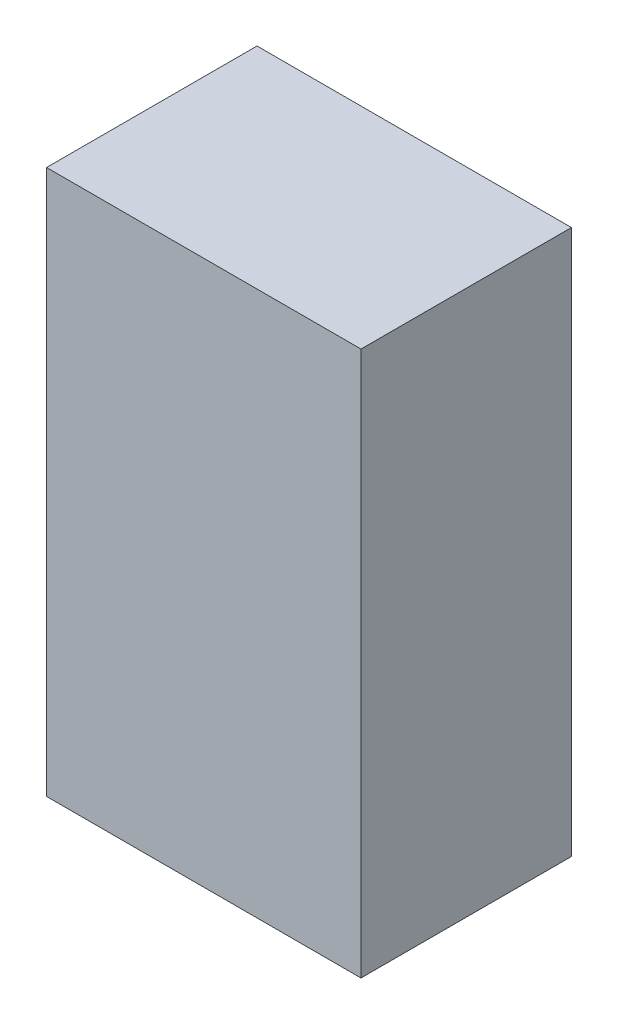
ISO-10303-21;
HEADER;
FILE_DESCRIPTION(('STEP AP214'),'2;1');
FILE_NAME('part.step','',(''),(''),'','','');
FILE_SCHEMA(('AUTOMOTIVE_DESIGN { 1 0 10303 214 1 1 1 1 }'));
ENDSEC;
DATA;
#1=APPLICATION_CONTEXT('core data for automotive mechanical design processes');
#2=APPLICATION_PROTOCOL_DEFINITION('international standard','automotive_design',2000,#1);
#3=PRODUCT_CONTEXT('',#1,'mechanical');
#4=PRODUCT('Part','Part','',(#3));
#5=PRODUCT_RELATED_PRODUCT_CATEGORY('part','',(#4));
#6=PRODUCT_DEFINITION_FORMATION('','',#4);
#7=PRODUCT_DEFINITION_CONTEXT('part definition',#1,'design');
#8=PRODUCT_DEFINITION('design','',#6,#7);
#9=PRODUCT_DEFINITION_SHAPE('','',#8);
#10=(LENGTH_UNIT() NAMED_UNIT(*) SI_UNIT(.MILLI.,.METRE.));
#11=(NAMED_UNIT(*) PLANE_ANGLE_UNIT() SI_UNIT($,.RADIAN.));
#12=(NAMED_UNIT(*) SI_UNIT($,.STERADIAN.) SOLID_ANGLE_UNIT());
#13=UNCERTAINTY_MEASURE_WITH_UNIT(LENGTH_MEASURE(1.E-05),#10,'distance_accuracy_value','');
#14=(GEOMETRIC_REPRESENTATION_CONTEXT(3) GLOBAL_UNCERTAINTY_ASSIGNED_CONTEXT((#13)) GLOBAL_UNIT_ASSIGNED_CONTEXT((#10,
#11,#12)) REPRESENTATION_CONTEXT('',''));
#15=CARTESIAN_POINT('',(0.,0.,0.));
#16=DIRECTION('',(0.,0.,1.));
#17=DIRECTION('',(1.,0.,0.));
#18=AXIS2_PLACEMENT_3D('',#15,#16,#17);
#19=CARTESIAN_POINT('',(0.635,1.10000034,0.85000084));
#20=DIRECTION('',(0.,0.,-1.));
#21=DIRECTION('',(-1.,0.,0.));
#22=AXIS2_PLACEMENT_3D('',#19,#20,#21);
#23=PLANE('',#22);
#24=DIRECTION('',(0.,1.,0.));
#25=VECTOR('',#24,1.);
#26=CARTESIAN_POINT('',(-0.635,1.10000034,0.85000084));
#27=LINE('',#26,#25);
#28=CARTESIAN_POINT('',(-0.635,1.10000034,0.85000084));
#29=VERTEX_POINT('',#28);
#30=CARTESIAN_POINT('',(-0.635,-1.10000034,0.85000084));
#31=VERTEX_POINT('',#30);
#32=EDGE_CURVE('E55',#29,#31,#27,.F.);
#33=ORIENTED_EDGE('',*,*,#32,.T.);
#34=DIRECTION('',(1.,0.,0.));
#35=VECTOR('',#34,1.);
#36=CARTESIAN_POINT('',(-0.635,-1.10000034,0.85000084));
#37=LINE('',#36,#35);
#38=CARTESIAN_POINT('',(0.635,-1.10000034,0.85000084));
#39=VERTEX_POINT('',#38);
#40=EDGE_CURVE('E58',#31,#39,#37,.T.);
#41=ORIENTED_EDGE('',*,*,#40,.T.);
#42=DIRECTION('',(0.,1.,0.));
#43=VECTOR('',#42,1.);
#44=CARTESIAN_POINT('',(0.635,-1.10000034,0.85000084));
#45=LINE('',#44,#43);
#46=CARTESIAN_POINT('',(0.635,1.10000034,0.85000084));
#47=VERTEX_POINT('',#46);
#48=EDGE_CURVE('E60',#39,#47,#45,.T.);
#49=ORIENTED_EDGE('',*,*,#48,.T.);
#50=DIRECTION('',(-1.,0.,0.));
#51=VECTOR('',#50,1.);
#52=CARTESIAN_POINT('',(0.635,1.10000034,0.85000084));
#53=LINE('',#52,#51);
#54=EDGE_CURVE('E20',#29,#47,#53,.F.);
#55=ORIENTED_EDGE('',*,*,#54,.F.);
#56=EDGE_LOOP('',(#33,#41,#49,#55));
#57=FACE_BOUND('',#56,.T.);
#58=ADVANCED_FACE('F17',(#57),#23,.F.);
#59=CARTESIAN_POINT('',(0.635,-1.10000034,0.));
#60=DIRECTION('',(-1.,0.,0.));
#61=DIRECTION('',(0.,0.,1.));
#62=AXIS2_PLACEMENT_3D('',#59,#60,#61);
#63=PLANE('',#62);
#64=DIRECTION('',(0.,0.,-1.));
#65=VECTOR('',#64,1.);
#66=CARTESIAN_POINT('',(0.635,1.10000034,0.));
#67=LINE('',#66,#65);
#68=CARTESIAN_POINT('',(0.635,1.10000034,0.));
#69=VERTEX_POINT('',#68);
#70=EDGE_CURVE('E71',#69,#47,#67,.F.);
#71=ORIENTED_EDGE('',*,*,#70,.T.);
#72=ORIENTED_EDGE('',*,*,#48,.F.);
#73=DIRECTION('',(0.,0.,1.));
#74=VECTOR('',#73,1.);
#75=CARTESIAN_POINT('',(0.635,-1.10000034,0.));
#76=LINE('',#75,#74);
#77=CARTESIAN_POINT('',(0.635,-1.10000034,0.));
#78=VERTEX_POINT('',#77);
#79=EDGE_CURVE('E65',#39,#78,#76,.F.);
#80=ORIENTED_EDGE('',*,*,#79,.T.);
#81=DIRECTION('',(0.,1.,0.));
#82=VECTOR('',#81,1.);
#83=CARTESIAN_POINT('',(0.635,1.10000034,0.));
#84=LINE('',#83,#82);
#85=EDGE_CURVE('E83',#69,#78,#84,.F.);
#86=ORIENTED_EDGE('',*,*,#85,.F.);
#87=EDGE_LOOP('',(#71,#72,#80,#86));
#88=FACE_BOUND('',#87,.T.);
#89=ADVANCED_FACE('F68',(#88),#63,.F.);
#90=CARTESIAN_POINT('',(-0.635,-1.10000034,0.));
#91=DIRECTION('',(0.,1.,0.));
#92=DIRECTION('',(0.,0.,1.));
#93=AXIS2_PLACEMENT_3D('',#90,#91,#92);
#94=PLANE('',#93);
#95=ORIENTED_EDGE('',*,*,#79,.F.);
#96=ORIENTED_EDGE('',*,*,#40,.F.);
#97=DIRECTION('',(0.,0.,-1.));
#98=VECTOR('',#97,1.);
#99=CARTESIAN_POINT('',(-0.635,-1.10000034,0.));
#100=LINE('',#99,#98);
#101=CARTESIAN_POINT('',(-0.635,-1.10000034,0.));
#102=VERTEX_POINT('',#101);
#103=EDGE_CURVE('E77',#31,#102,#100,.T.);
#104=ORIENTED_EDGE('',*,*,#103,.T.);
#105=DIRECTION('',(-1.,0.,0.));
#106=VECTOR('',#105,1.);
#107=CARTESIAN_POINT('',(0.635,-1.10000034,0.));
#108=LINE('',#107,#106);
#109=EDGE_CURVE('E74',#78,#102,#108,.T.);
#110=ORIENTED_EDGE('',*,*,#109,.F.);
#111=EDGE_LOOP('',(#95,#96,#104,#110));
#112=FACE_BOUND('',#111,.T.);
#113=ADVANCED_FACE('F72',(#112),#94,.F.);
#114=CARTESIAN_POINT('',(-0.635,1.10000034,0.));
#115=DIRECTION('',(1.,0.,0.));
#116=DIRECTION('',(0.,0.,-1.));
#117=AXIS2_PLACEMENT_3D('',#114,#115,#116);
#118=PLANE('',#117);
#119=ORIENTED_EDGE('',*,*,#103,.F.);
#120=ORIENTED_EDGE('',*,*,#32,.F.);
#121=DIRECTION('',(0.,0.,-1.));
#122=VECTOR('',#121,1.);
#123=CARTESIAN_POINT('',(-0.635,1.10000034,0.));
#124=LINE('',#123,#122);
#125=CARTESIAN_POINT('',(-0.635,1.10000034,0.));
#126=VERTEX_POINT('',#125);
#127=EDGE_CURVE('E35',#29,#126,#124,.T.);
#128=ORIENTED_EDGE('',*,*,#127,.T.);
#129=DIRECTION('',(0.,1.,0.));
#130=VECTOR('',#129,1.);
#131=CARTESIAN_POINT('',(-0.635,1.10000034,0.));
#132=LINE('',#131,#130);
#133=EDGE_CURVE('E26',#102,#126,#132,.T.);
#134=ORIENTED_EDGE('',*,*,#133,.F.);
#135=EDGE_LOOP('',(#119,#120,#128,#134));
#136=FACE_BOUND('',#135,.T.);
#137=ADVANCED_FACE('F89',(#136),#118,.F.);
#138=CARTESIAN_POINT('',(0.635,1.10000034,0.));
#139=DIRECTION('',(0.,-1.,0.));
#140=DIRECTION('',(0.,0.,-1.));
#141=AXIS2_PLACEMENT_3D('',#138,#139,#140);
#142=PLANE('',#141);
#143=ORIENTED_EDGE('',*,*,#127,.F.);
#144=ORIENTED_EDGE('',*,*,#54,.T.);
#145=ORIENTED_EDGE('',*,*,#70,.F.);
#146=DIRECTION('',(-1.,0.,0.));
#147=VECTOR('',#146,1.);
#148=CARTESIAN_POINT('',(0.635,1.10000034,0.));
#149=LINE('',#148,#147);
#150=EDGE_CURVE('E11',#126,#69,#149,.F.);
#151=ORIENTED_EDGE('',*,*,#150,.F.);
#152=EDGE_LOOP('',(#143,#144,#145,#151));
#153=FACE_BOUND('',#152,.T.);
#154=ADVANCED_FACE('F91',(#153),#142,.F.);
#155=CARTESIAN_POINT('',(0.635,1.10000034,0.));
#156=DIRECTION('',(0.,0.,-1.));
#157=DIRECTION('',(-1.,0.,0.));
#158=AXIS2_PLACEMENT_3D('',#155,#156,#157);
#159=PLANE('',#158);
#160=ORIENTED_EDGE('',*,*,#133,.T.);
#161=ORIENTED_EDGE('',*,*,#150,.T.);
#162=ORIENTED_EDGE('',*,*,#85,.T.);
#163=ORIENTED_EDGE('',*,*,#109,.T.);
#164=EDGE_LOOP('',(#160,#161,#162,#163));
#165=FACE_BOUND('',#164,.T.);
#166=ADVANCED_FACE('F88',(#165),#159,.T.);
#167=CLOSED_SHELL('',(#58,#89,#113,#137,#154,#166));
#168=MANIFOLD_SOLID_BREP('B1',#167);
#169=ADVANCED_BREP_SHAPE_REPRESENTATION('',(#18,#168),#14);
#170=SHAPE_DEFINITION_REPRESENTATION(#9,#169);
ENDSEC;
END-ISO-10303-21;
